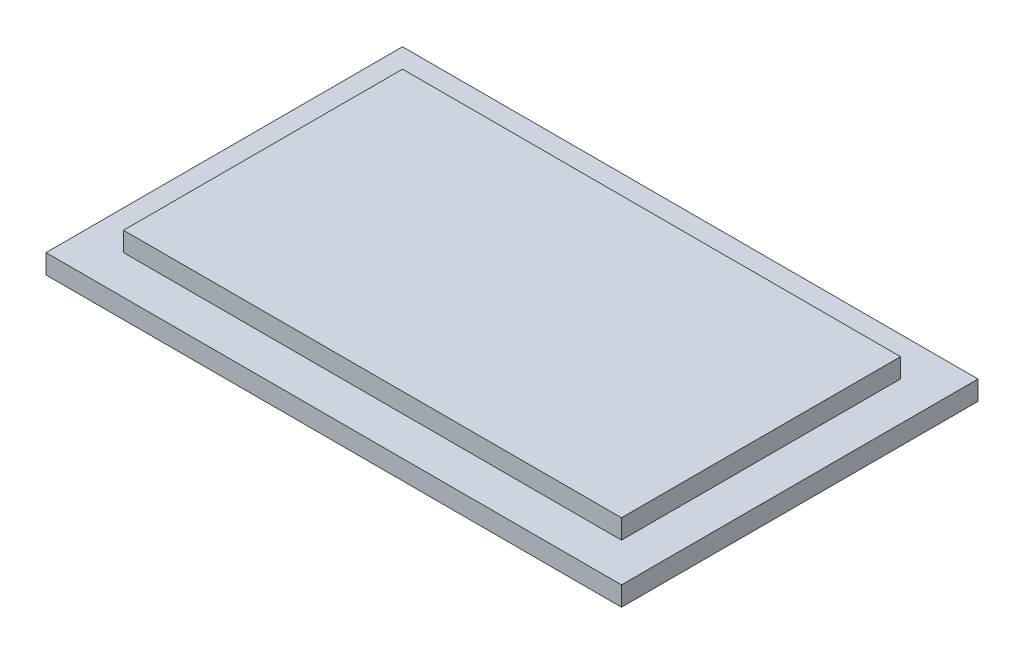
ISO-10303-21;
HEADER;
FILE_DESCRIPTION(('STEP AP214'),'2;1');
FILE_NAME('part.step','',(''),(''),'','','');
FILE_SCHEMA(('AUTOMOTIVE_DESIGN { 1 0 10303 214 1 1 1 1 }'));
ENDSEC;
DATA;
#1=APPLICATION_CONTEXT('core data for automotive mechanical design processes');
#2=APPLICATION_PROTOCOL_DEFINITION('international standard','automotive_design',2000,#1);
#3=PRODUCT_CONTEXT('',#1,'mechanical');
#4=PRODUCT('Part','Part','',(#3));
#5=PRODUCT_RELATED_PRODUCT_CATEGORY('part','',(#4));
#6=PRODUCT_DEFINITION_FORMATION('','',#4);
#7=PRODUCT_DEFINITION_CONTEXT('part definition',#1,'design');
#8=PRODUCT_DEFINITION('design','',#6,#7);
#9=PRODUCT_DEFINITION_SHAPE('','',#8);
#10=(LENGTH_UNIT() NAMED_UNIT(*) SI_UNIT(.MILLI.,.METRE.));
#11=(NAMED_UNIT(*) PLANE_ANGLE_UNIT() SI_UNIT($,.RADIAN.));
#12=(NAMED_UNIT(*) SI_UNIT($,.STERADIAN.) SOLID_ANGLE_UNIT());
#13=UNCERTAINTY_MEASURE_WITH_UNIT(LENGTH_MEASURE(1.E-05),#10,'distance_accuracy_value','');
#14=(GEOMETRIC_REPRESENTATION_CONTEXT(3) GLOBAL_UNCERTAINTY_ASSIGNED_CONTEXT((#13)) GLOBAL_UNIT_ASSIGNED_CONTEXT((#10,
#11,#12)) REPRESENTATION_CONTEXT('',''));
#15=CARTESIAN_POINT('',(0.,0.,0.));
#16=DIRECTION('',(0.,0.,1.));
#17=DIRECTION('',(1.,0.,0.));
#18=AXIS2_PLACEMENT_3D('',#15,#16,#17);
#19=CARTESIAN_POINT('',(11.2615232295871,-1.,-2.94800501880153));
#20=DIRECTION('',(0.,0.,-1.));
#21=DIRECTION('',(-1.,0.,0.));
#22=AXIS2_PLACEMENT_3D('',#19,#20,#21);
#23=PLANE('',#22);
#24=DIRECTION('',(-1.,0.,0.));
#25=VECTOR('',#24,1.);
#26=CARTESIAN_POINT('',(11.2615232295871,0.,-2.94800501880153));
#27=LINE('',#26,#25);
#28=CARTESIAN_POINT('',(11.2615232295871,0.,-2.94800501880153));
#29=VERTEX_POINT('',#28);
#30=CARTESIAN_POINT('',(-18.4384767704069,0.,-2.94800501880153));
#31=VERTEX_POINT('',#30);
#32=EDGE_CURVE('E128',#29,#31,#27,.T.);
#33=ORIENTED_EDGE('',*,*,#32,.F.);
#34=DIRECTION('',(0.,1.,0.));
#35=VECTOR('',#34,1.);
#36=CARTESIAN_POINT('',(11.2615232295871,-1.,-2.94800501880153));
#37=LINE('',#36,#35);
#38=CARTESIAN_POINT('',(11.2615232295871,-1.,-2.94800501880153));
#39=VERTEX_POINT('',#38);
#40=EDGE_CURVE('E11',#39,#29,#37,.T.);
#41=ORIENTED_EDGE('',*,*,#40,.F.);
#42=DIRECTION('',(-1.,0.,0.));
#43=VECTOR('',#42,1.);
#44=CARTESIAN_POINT('',(11.2615232295871,-1.,-2.94800501880153));
#45=LINE('',#44,#43);
#46=CARTESIAN_POINT('',(-18.4384767704069,-1.,-2.94800501880153));
#47=VERTEX_POINT('',#46);
#48=EDGE_CURVE('E139',#39,#47,#45,.T.);
#49=ORIENTED_EDGE('',*,*,#48,.T.);
#50=DIRECTION('',(0.,1.,0.));
#51=VECTOR('',#50,1.);
#52=CARTESIAN_POINT('',(-18.4384767704069,-1.,-2.94800501880153));
#53=LINE('',#52,#51);
#54=EDGE_CURVE('E42',#47,#31,#53,.T.);
#55=ORIENTED_EDGE('',*,*,#54,.T.);
#56=EDGE_LOOP('',(#33,#41,#49,#55));
#57=FACE_BOUND('',#56,.T.);
#58=ADVANCED_FACE('F39',(#57),#23,.T.);
#59=CARTESIAN_POINT('',(11.2615232295871,-1.,15.4519949811985));
#60=DIRECTION('',(1.,0.,0.));
#61=DIRECTION('',(0.,0.,-1.));
#62=AXIS2_PLACEMENT_3D('',#59,#60,#61);
#63=PLANE('',#62);
#64=DIRECTION('',(0.,0.,-1.));
#65=VECTOR('',#64,1.);
#66=CARTESIAN_POINT('',(11.2615232295871,0.,15.4519949811985));
#67=LINE('',#66,#65);
#68=CARTESIAN_POINT('',(11.2615232295871,0.,15.4519949811985));
#69=VERTEX_POINT('',#68);
#70=EDGE_CURVE('E144',#69,#29,#67,.T.);
#71=ORIENTED_EDGE('',*,*,#70,.F.);
#72=DIRECTION('',(0.,1.,0.));
#73=VECTOR('',#72,1.);
#74=CARTESIAN_POINT('',(11.2615232295871,-1.,15.4519949811985));
#75=LINE('',#74,#73);
#76=CARTESIAN_POINT('',(11.2615232295871,-1.,15.4519949811985));
#77=VERTEX_POINT('',#76);
#78=EDGE_CURVE('E48',#77,#69,#75,.T.);
#79=ORIENTED_EDGE('',*,*,#78,.F.);
#80=DIRECTION('',(0.,0.,-1.));
#81=VECTOR('',#80,1.);
#82=CARTESIAN_POINT('',(11.2615232295871,-1.,15.4519949811985));
#83=LINE('',#82,#81);
#84=EDGE_CURVE('E152',#77,#39,#83,.T.);
#85=ORIENTED_EDGE('',*,*,#84,.T.);
#86=ORIENTED_EDGE('',*,*,#40,.T.);
#87=EDGE_LOOP('',(#71,#79,#85,#86));
#88=FACE_BOUND('',#87,.T.);
#89=ADVANCED_FACE('F182',(#88),#63,.T.);
#90=CARTESIAN_POINT('',(-18.4384767704069,-1.,15.4519949811985));
#91=DIRECTION('',(0.,0.,1.));
#92=DIRECTION('',(1.,0.,0.));
#93=AXIS2_PLACEMENT_3D('',#90,#91,#92);
#94=PLANE('',#93);
#95=DIRECTION('',(1.,0.,0.));
#96=VECTOR('',#95,1.);
#97=CARTESIAN_POINT('',(-18.4384767704069,0.,15.4519949811985));
#98=LINE('',#97,#96);
#99=CARTESIAN_POINT('',(-18.4384767704069,0.,15.4519949811985));
#100=VERTEX_POINT('',#99);
#101=EDGE_CURVE('E159',#100,#69,#98,.T.);
#102=ORIENTED_EDGE('',*,*,#101,.F.);
#103=DIRECTION('',(0.,1.,0.));
#104=VECTOR('',#103,1.);
#105=CARTESIAN_POINT('',(-18.4384767704069,-1.,15.4519949811985));
#106=LINE('',#105,#104);
#107=CARTESIAN_POINT('',(-18.4384767704069,-1.,15.4519949811985));
#108=VERTEX_POINT('',#107);
#109=EDGE_CURVE('E167',#108,#100,#106,.T.);
#110=ORIENTED_EDGE('',*,*,#109,.F.);
#111=DIRECTION('',(1.,0.,0.));
#112=VECTOR('',#111,1.);
#113=CARTESIAN_POINT('',(-18.4384767704069,-1.,15.4519949811985));
#114=LINE('',#113,#112);
#115=EDGE_CURVE('E148',#108,#77,#114,.T.);
#116=ORIENTED_EDGE('',*,*,#115,.T.);
#117=ORIENTED_EDGE('',*,*,#78,.T.);
#118=EDGE_LOOP('',(#102,#110,#116,#117));
#119=FACE_BOUND('',#118,.T.);
#120=ADVANCED_FACE('F188',(#119),#94,.T.);
#121=CARTESIAN_POINT('',(-18.4384767704069,-1.,-2.94800501880153));
#122=DIRECTION('',(-1.,0.,0.));
#123=DIRECTION('',(0.,0.,1.));
#124=AXIS2_PLACEMENT_3D('',#121,#122,#123);
#125=PLANE('',#124);
#126=DIRECTION('',(0.,0.,1.));
#127=VECTOR('',#126,1.);
#128=CARTESIAN_POINT('',(-18.4384767704069,0.,-2.94800501880153));
#129=LINE('',#128,#127);
#130=EDGE_CURVE('E133',#31,#100,#129,.T.);
#131=ORIENTED_EDGE('',*,*,#130,.F.);
#132=ORIENTED_EDGE('',*,*,#54,.F.);
#133=DIRECTION('',(0.,0.,1.));
#134=VECTOR('',#133,1.);
#135=CARTESIAN_POINT('',(-18.4384767704069,-1.,-2.94800501880153));
#136=LINE('',#135,#134);
#137=EDGE_CURVE('E143',#47,#108,#136,.T.);
#138=ORIENTED_EDGE('',*,*,#137,.T.);
#139=ORIENTED_EDGE('',*,*,#109,.T.);
#140=EDGE_LOOP('',(#131,#132,#138,#139));
#141=FACE_BOUND('',#140,.T.);
#142=ADVANCED_FACE('F177',(#141),#125,.T.);
#143=CARTESIAN_POINT('',(0.,-1.,0.));
#144=DIRECTION('',(0.,1.,0.));
#145=DIRECTION('',(0.,0.,1.));
#146=AXIS2_PLACEMENT_3D('',#143,#144,#145);
#147=PLANE('',#146);
#148=ORIENTED_EDGE('',*,*,#48,.F.);
#149=ORIENTED_EDGE('',*,*,#84,.F.);
#150=ORIENTED_EDGE('',*,*,#115,.F.);
#151=ORIENTED_EDGE('',*,*,#137,.F.);
#152=EDGE_LOOP('',(#148,#149,#150,#151));
#153=FACE_BOUND('',#152,.T.);
#154=ADVANCED_FACE('F185',(#153),#147,.F.);
#155=CARTESIAN_POINT('',(0.,0.,0.));
#156=DIRECTION('',(0.,1.,0.));
#157=DIRECTION('',(0.,0.,1.));
#158=AXIS2_PLACEMENT_3D('',#155,#156,#157);
#159=PLANE('',#158);
#160=DIRECTION('',(-1.,0.,0.));
#161=VECTOR('',#160,1.);
#162=CARTESIAN_POINT('',(9.26152322958714,0.,-0.948005018801527));
#163=LINE('',#162,#161);
#164=CARTESIAN_POINT('',(9.26152322958714,0.,-0.948005018801527));
#165=VERTEX_POINT('',#164);
#166=CARTESIAN_POINT('',(-16.4384767704069,0.,-0.948005018801527));
#167=VERTEX_POINT('',#166);
#168=EDGE_CURVE('E56',#165,#167,#163,.T.);
#169=ORIENTED_EDGE('',*,*,#168,.F.);
#170=DIRECTION('',(0.,0.,-1.));
#171=VECTOR('',#170,1.);
#172=CARTESIAN_POINT('',(9.26152322958714,0.,13.4519949811985));
#173=LINE('',#172,#171);
#174=CARTESIAN_POINT('',(9.26152322958714,0.,13.4519949811985));
#175=VERTEX_POINT('',#174);
#176=EDGE_CURVE('E60',#175,#165,#173,.T.);
#177=ORIENTED_EDGE('',*,*,#176,.F.);
#178=DIRECTION('',(1.,0.,0.));
#179=VECTOR('',#178,1.);
#180=CARTESIAN_POINT('',(-16.4384767704069,0.,13.4519949811985));
#181=LINE('',#180,#179);
#182=CARTESIAN_POINT('',(-16.4384767704069,0.,13.4519949811985));
#183=VERTEX_POINT('',#182);
#184=EDGE_CURVE('E281',#183,#175,#181,.T.);
#185=ORIENTED_EDGE('',*,*,#184,.F.);
#186=DIRECTION('',(0.,0.,1.));
#187=VECTOR('',#186,1.);
#188=CARTESIAN_POINT('',(-16.4384767704069,0.,-0.948005018801527));
#189=LINE('',#188,#187);
#190=EDGE_CURVE('E291',#167,#183,#189,.T.);
#191=ORIENTED_EDGE('',*,*,#190,.F.);
#192=EDGE_LOOP('',(#169,#177,#185,#191));
#193=FACE_BOUND('',#192,.T.);
#194=ORIENTED_EDGE('',*,*,#32,.T.);
#195=ORIENTED_EDGE('',*,*,#130,.T.);
#196=ORIENTED_EDGE('',*,*,#101,.T.);
#197=ORIENTED_EDGE('',*,*,#70,.T.);
#198=EDGE_LOOP('',(#194,#195,#196,#197));
#199=FACE_BOUND('',#198,.T.);
#200=ADVANCED_FACE('F179',(#193,#199),#159,.T.);
#201=CARTESIAN_POINT('',(9.26152322958714,1.,-0.948005018801527));
#202=DIRECTION('',(0.,0.,1.));
#203=DIRECTION('',(1.,0.,0.));
#204=AXIS2_PLACEMENT_3D('',#201,#202,#203);
#205=PLANE('',#204);
#206=ORIENTED_EDGE('',*,*,#168,.T.);
#207=DIRECTION('',(0.,-1.,0.));
#208=VECTOR('',#207,1.);
#209=CARTESIAN_POINT('',(-16.4384767704069,1.,-0.948005018801527));
#210=LINE('',#209,#208);
#211=CARTESIAN_POINT('',(-16.4384767704069,1.,-0.948005018801527));
#212=VERTEX_POINT('',#211);
#213=EDGE_CURVE('E108',#212,#167,#210,.T.);
#214=ORIENTED_EDGE('',*,*,#213,.F.);
#215=DIRECTION('',(-1.,0.,0.));
#216=VECTOR('',#215,1.);
#217=CARTESIAN_POINT('',(9.26152322958714,1.,-0.948005018801527));
#218=LINE('',#217,#216);
#219=CARTESIAN_POINT('',(9.26152322958714,1.,-0.948005018801527));
#220=VERTEX_POINT('',#219);
#221=EDGE_CURVE('E115',#220,#212,#218,.T.);
#222=ORIENTED_EDGE('',*,*,#221,.F.);
#223=DIRECTION('',(0.,-1.,0.));
#224=VECTOR('',#223,1.);
#225=CARTESIAN_POINT('',(9.26152322958714,1.,-0.948005018801527));
#226=LINE('',#225,#224);
#227=EDGE_CURVE('E278',#220,#165,#226,.T.);
#228=ORIENTED_EDGE('',*,*,#227,.T.);
#229=EDGE_LOOP('',(#206,#214,#222,#228));
#230=FACE_BOUND('',#229,.T.);
#231=ADVANCED_FACE('F126',(#230),#205,.F.);
#232=CARTESIAN_POINT('',(-16.4384767704069,1.,-0.948005018801527));
#233=DIRECTION('',(1.,0.,0.));
#234=DIRECTION('',(0.,0.,-1.));
#235=AXIS2_PLACEMENT_3D('',#232,#233,#234);
#236=PLANE('',#235);
#237=ORIENTED_EDGE('',*,*,#190,.T.);
#238=DIRECTION('',(0.,-1.,0.));
#239=VECTOR('',#238,1.);
#240=CARTESIAN_POINT('',(-16.4384767704069,1.,13.4519949811985));
#241=LINE('',#240,#239);
#242=CARTESIAN_POINT('',(-16.4384767704069,1.,13.4519949811985));
#243=VERTEX_POINT('',#242);
#244=EDGE_CURVE('E110',#243,#183,#241,.T.);
#245=ORIENTED_EDGE('',*,*,#244,.F.);
#246=DIRECTION('',(0.,0.,1.));
#247=VECTOR('',#246,1.);
#248=CARTESIAN_POINT('',(-16.4384767704069,1.,-0.948005018801527));
#249=LINE('',#248,#247);
#250=EDGE_CURVE('E103',#212,#243,#249,.T.);
#251=ORIENTED_EDGE('',*,*,#250,.F.);
#252=ORIENTED_EDGE('',*,*,#213,.T.);
#253=EDGE_LOOP('',(#237,#245,#251,#252));
#254=FACE_BOUND('',#253,.T.);
#255=ADVANCED_FACE('F106',(#254),#236,.F.);
#256=CARTESIAN_POINT('',(-16.4384767704069,1.,13.4519949811985));
#257=DIRECTION('',(0.,0.,-1.));
#258=DIRECTION('',(-1.,0.,0.));
#259=AXIS2_PLACEMENT_3D('',#256,#257,#258);
#260=PLANE('',#259);
#261=ORIENTED_EDGE('',*,*,#184,.T.);
#262=DIRECTION('',(0.,-1.,0.));
#263=VECTOR('',#262,1.);
#264=CARTESIAN_POINT('',(9.26152322958714,1.,13.4519949811985));
#265=LINE('',#264,#263);
#266=CARTESIAN_POINT('',(9.26152322958714,1.,13.4519949811985));
#267=VERTEX_POINT('',#266);
#268=EDGE_CURVE('E135',#267,#175,#265,.T.);
#269=ORIENTED_EDGE('',*,*,#268,.F.);
#270=DIRECTION('',(1.,0.,0.));
#271=VECTOR('',#270,1.);
#272=CARTESIAN_POINT('',(-16.4384767704069,1.,13.4519949811985));
#273=LINE('',#272,#271);
#274=EDGE_CURVE('E114',#243,#267,#273,.T.);
#275=ORIENTED_EDGE('',*,*,#274,.F.);
#276=ORIENTED_EDGE('',*,*,#244,.T.);
#277=EDGE_LOOP('',(#261,#269,#275,#276));
#278=FACE_BOUND('',#277,.T.);
#279=ADVANCED_FACE('F246',(#278),#260,.F.);
#280=CARTESIAN_POINT('',(9.26152322958714,1.,13.4519949811985));
#281=DIRECTION('',(-1.,0.,0.));
#282=DIRECTION('',(0.,0.,1.));
#283=AXIS2_PLACEMENT_3D('',#280,#281,#282);
#284=PLANE('',#283);
#285=ORIENTED_EDGE('',*,*,#176,.T.);
#286=ORIENTED_EDGE('',*,*,#227,.F.);
#287=DIRECTION('',(0.,0.,-1.));
#288=VECTOR('',#287,1.);
#289=CARTESIAN_POINT('',(9.26152322958714,1.,13.4519949811985));
#290=LINE('',#289,#288);
#291=EDGE_CURVE('E120',#267,#220,#290,.T.);
#292=ORIENTED_EDGE('',*,*,#291,.F.);
#293=ORIENTED_EDGE('',*,*,#268,.T.);
#294=EDGE_LOOP('',(#285,#286,#292,#293));
#295=FACE_BOUND('',#294,.T.);
#296=ADVANCED_FACE('F255',(#295),#284,.F.);
#297=CARTESIAN_POINT('',(0.,1.,0.));
#298=DIRECTION('',(0.,1.,0.));
#299=DIRECTION('',(0.,0.,1.));
#300=AXIS2_PLACEMENT_3D('',#297,#298,#299);
#301=PLANE('',#300);
#302=ORIENTED_EDGE('',*,*,#221,.T.);
#303=ORIENTED_EDGE('',*,*,#250,.T.);
#304=ORIENTED_EDGE('',*,*,#274,.T.);
#305=ORIENTED_EDGE('',*,*,#291,.T.);
#306=EDGE_LOOP('',(#302,#303,#304,#305));
#307=FACE_BOUND('',#306,.T.);
#308=ADVANCED_FACE('F118',(#307),#301,.T.);
#309=CLOSED_SHELL('',(#58,#89,#120,#142,#154,#200,#231,#255,#279,#296,#308));
#310=MANIFOLD_SOLID_BREP('B2',#309);
#311=ADVANCED_BREP_SHAPE_REPRESENTATION('',(#18,#310),#14);
#312=SHAPE_DEFINITION_REPRESENTATION(#9,#311);
ENDSEC;
END-ISO-10303-21;
